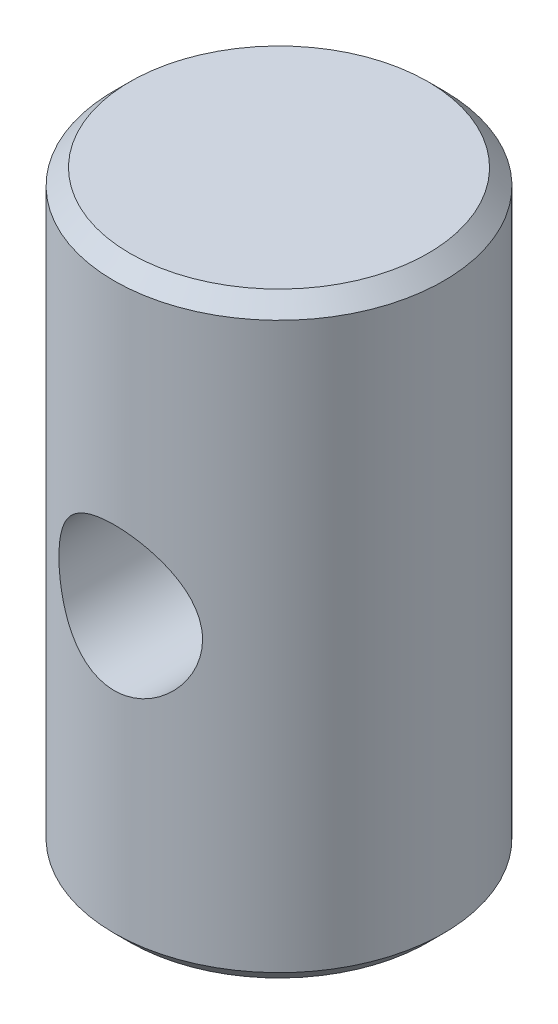
ISO-10303-21;
HEADER;
FILE_DESCRIPTION(('STEP AP214'),'2;1');
FILE_NAME('part.step','',(''),(''),'','','');
FILE_SCHEMA(('AUTOMOTIVE_DESIGN { 1 0 10303 214 1 1 1 1 }'));
ENDSEC;
DATA;
#1=APPLICATION_CONTEXT('core data for automotive mechanical design processes');
#2=APPLICATION_PROTOCOL_DEFINITION('international standard','automotive_design',2000,#1);
#3=PRODUCT_CONTEXT('',#1,'mechanical');
#4=PRODUCT('Part','Part','',(#3));
#5=PRODUCT_RELATED_PRODUCT_CATEGORY('part','',(#4));
#6=PRODUCT_DEFINITION_FORMATION('','',#4);
#7=PRODUCT_DEFINITION_CONTEXT('part definition',#1,'design');
#8=PRODUCT_DEFINITION('design','',#6,#7);
#9=PRODUCT_DEFINITION_SHAPE('','',#8);
#10=(LENGTH_UNIT() NAMED_UNIT(*) SI_UNIT(.MILLI.,.METRE.));
#11=(NAMED_UNIT(*) PLANE_ANGLE_UNIT() SI_UNIT($,.RADIAN.));
#12=(NAMED_UNIT(*) SI_UNIT($,.STERADIAN.) SOLID_ANGLE_UNIT());
#13=UNCERTAINTY_MEASURE_WITH_UNIT(LENGTH_MEASURE(1.E-05),#10,'distance_accuracy_value','');
#14=(GEOMETRIC_REPRESENTATION_CONTEXT(3) GLOBAL_UNCERTAINTY_ASSIGNED_CONTEXT((#13)) GLOBAL_UNIT_ASSIGNED_CONTEXT((#10,
#11,#12)) REPRESENTATION_CONTEXT('',''));
#15=CARTESIAN_POINT('',(0.,0.,0.));
#16=DIRECTION('',(0.,0.,1.));
#17=DIRECTION('',(1.,0.,0.));
#18=AXIS2_PLACEMENT_3D('',#15,#16,#17);
#19=CARTESIAN_POINT('',(0.,14.351,0.));
#20=DIRECTION('',(0.,-1.,0.));
#21=DIRECTION('',(0.,0.,-1.));
#22=AXIS2_PLACEMENT_3D('',#19,#20,#21);
#23=CYLINDRICAL_SURFACE('',#22,3.9624);
#24=CARTESIAN_POINT('',(1.72719999999999,7.1628,3.56614552703616));
#25=CARTESIAN_POINT('',(1.72719589741108,7.07113387059166,3.56614993077733));
#26=CARTESIAN_POINT('',(1.7198563547776,6.9793146178966,3.56973092522893));
#27=CARTESIAN_POINT('',(1.69081256466767,6.79836471975493,3.58357547788538));
#28=CARTESIAN_POINT('',(1.66907105976061,6.70924167628412,3.59385636739064));
#29=CARTESIAN_POINT('',(1.61224827694548,6.53662551523054,3.61970021391957));
#30=CARTESIAN_POINT('',(1.57722487269376,6.45310979708089,3.63524022403528));
#31=CARTESIAN_POINT('',(1.49500578565154,6.29316182054083,3.66981650660831));
#32=CARTESIAN_POINT('',(1.44781218552927,6.21672835321407,3.68885218069734));
#33=CARTESIAN_POINT('',(1.33915027419395,6.06785473138358,3.72972629681702));
#34=CARTESIAN_POINT('',(1.27697890078482,5.99595508122913,3.75166530796737));
#35=CARTESIAN_POINT('',(1.1415997053979,5.8631987124269,3.79505136644032));
#36=CARTESIAN_POINT('',(1.06838740960763,5.80234649235768,3.81649821025787));
#37=CARTESIAN_POINT('',(0.908670114004438,5.69056161394339,3.85772570091534));
#38=CARTESIAN_POINT('',(0.821694106038829,5.64024944000791,3.8773759773678));
#39=CARTESIAN_POINT('',(0.639499839563158,5.55520813096961,3.91154996359957));
#40=CARTESIAN_POINT('',(0.544285594873899,5.52047145763201,3.92607615260836));
#41=CARTESIAN_POINT('',(0.354004474453537,5.46956458647761,3.94764982511964));
#42=CARTESIAN_POINT('',(0.259231279574775,5.45245895379762,3.95507241461706));
#43=CARTESIAN_POINT('',(0.0678890738924134,5.43426453734702,3.96297326142524));
#44=CARTESIAN_POINT('',(-0.0286791157575744,5.43316860182497,3.96345461947811));
#45=CARTESIAN_POINT('',(-0.21401993129242,5.44656196520325,3.95763057708474));
#46=CARTESIAN_POINT('',(-0.302883957933034,5.46001982846568,3.95177430819683));
#47=CARTESIAN_POINT('',(-0.476944676567913,5.50035407791297,3.9345633932956));
#48=CARTESIAN_POINT('',(-0.562141096735372,5.52723145683962,3.92320834049804));
#49=CARTESIAN_POINT('',(-0.728026639089413,5.5939421456383,3.89586603541674));
#50=CARTESIAN_POINT('',(-0.808626905603861,5.63396730489782,3.87981059847104));
#51=CARTESIAN_POINT('',(-0.9621790800613,5.72563783228495,3.84461178823216));
#52=CARTESIAN_POINT('',(-1.03512820484004,5.77728740754321,3.82546729765473));
#53=CARTESIAN_POINT('',(-1.17721181969114,5.89529983549193,3.78426569350375));
#54=CARTESIAN_POINT('',(-1.24563357525797,5.96248324454074,3.76209779908373));
#55=CARTESIAN_POINT('',(-1.37056544109138,6.10737251655165,3.71840738174161));
#56=CARTESIAN_POINT('',(-1.4270700545781,6.18508320819918,3.69688516054486));
#57=CARTESIAN_POINT('',(-1.52864446774681,6.35260056060402,3.65608781778757));
#58=CARTESIAN_POINT('',(-1.57318542786002,6.44275959623804,3.63693230997906));
#59=CARTESIAN_POINT('',(-1.64615514374342,6.63035261029733,3.60449719801011));
#60=CARTESIAN_POINT('',(-1.67459667664862,6.72778074997144,3.59121293604016));
#61=CARTESIAN_POINT('',(-1.71265446245399,6.91998586667292,3.57321211924259));
#62=CARTESIAN_POINT('',(-1.72343422801931,7.01448193413677,3.5679676487184));
#63=CARTESIAN_POINT('',(-1.72930635611274,7.20405814926641,3.56512687568415));
#64=CARTESIAN_POINT('',(-1.72440506063362,7.29913804528603,3.56752748122481));
#65=CARTESIAN_POINT('',(-1.70011832298708,7.4798545126876,3.5791569267607));
#66=CARTESIAN_POINT('',(-1.68181579551821,7.56567392560942,3.58787477116406));
#67=CARTESIAN_POINT('',(-1.63271771102618,7.73293532205738,3.61048078266554));
#68=CARTESIAN_POINT('',(-1.60191904401184,7.81437621015468,3.62437023678313));
#69=CARTESIAN_POINT('',(-1.52720876846257,7.97459431983546,3.65649623494314));
#70=CARTESIAN_POINT('',(-1.48277877423512,8.05309568427869,3.67489747406086));
#71=CARTESIAN_POINT('',(-1.38256674795293,8.20192765054499,3.71375937788475));
#72=CARTESIAN_POINT('',(-1.32677949731932,8.27225447280262,3.73422098712417));
#73=CARTESIAN_POINT('',(-1.19948482874214,8.40938735909963,3.77713548868492));
#74=CARTESIAN_POINT('',(-1.12701063383752,8.47529586406847,3.79960069661503));
#75=CARTESIAN_POINT('',(-0.971535731074497,8.59420328023158,3.84229423811627));
#76=CARTESIAN_POINT('',(-0.888533778841646,8.64720066317279,3.86252230672895));
#77=CARTESIAN_POINT('',(-0.713363972849648,8.73892270332071,3.89868757505321));
#78=CARTESIAN_POINT('',(-0.621139909518708,8.77755209321188,3.91459595172678));
#79=CARTESIAN_POINT('',(-0.430623283302368,8.83843900311843,3.9401000488249));
#80=CARTESIAN_POINT('',(-0.332334757521396,8.86070728991486,3.94969992025898));
#81=CARTESIAN_POINT('',(-0.140461012272613,8.88679276605566,3.96098741868394));
#82=CARTESIAN_POINT('',(-0.0470781868625247,8.89187193505369,3.96321592377827));
#83=CARTESIAN_POINT('',(0.139194491913483,8.88689964312438,3.96104868747177));
#84=CARTESIAN_POINT('',(0.232084442924303,8.87685130073712,3.95665431137927));
#85=CARTESIAN_POINT('',(0.41073834890137,8.8428129906973,3.94203210863175));
#86=CARTESIAN_POINT('',(0.496638051959683,8.81941893219932,3.9320539492743));
#87=CARTESIAN_POINT('',(0.663238778514837,8.76003495200585,3.90740654114818));
#88=CARTESIAN_POINT('',(0.743938862312723,8.72404276103657,3.89273644727279));
#89=CARTESIAN_POINT('',(0.901932977314781,8.6386613837307,3.85926808870117));
#90=CARTESIAN_POINT('',(0.978901999050528,8.58873436390756,3.84031159534644));
#91=CARTESIAN_POINT('',(1.12370588773836,8.47765374175666,3.80046684162582));
#92=CARTESIAN_POINT('',(1.19153699805237,8.41649554650857,3.77957779269371));
#93=CARTESIAN_POINT('',(1.32148064662441,8.27926661955781,3.73622039367739));
#94=CARTESIAN_POINT('',(1.3827753146848,8.20241879921604,3.71375182625651));
#95=CARTESIAN_POINT('',(1.49175885005103,8.03888803959137,3.6713350648878));
#96=CARTESIAN_POINT('',(1.53943955533862,7.95219924366032,3.65138838687139));
#97=CARTESIAN_POINT('',(1.6196050663497,7.77101173405566,3.61654750540729));
#98=CARTESIAN_POINT('',(1.65207959254433,7.67650778789674,3.60165672165858));
#99=CARTESIAN_POINT('',(1.70023951426616,7.4826606357442,3.5791796844223));
#100=CARTESIAN_POINT('',(1.71598123416848,7.38333484894709,3.57156893429829));
#101=CARTESIAN_POINT('',(1.72438769192046,7.26337632757507,3.56750597176856));
#102=CARTESIAN_POINT('',(1.72544131653243,7.24328107414503,3.56699684271771));
#103=CARTESIAN_POINT('',(1.72684792846381,7.2030596765425,3.5663161331941));
#104=CARTESIAN_POINT('',(1.72720090109186,7.18293353173113,3.56614455979927));
#105=CARTESIAN_POINT('',(1.72719999999999,7.1628,3.56614552703616));
#106=B_SPLINE_CURVE_WITH_KNOTS('',3,(#24,#25,#26,#27,#28,#29,#30,#31,#32,#33,#34,#35,#36,#37,
#38,#39,#40,#41,#42,#43,#44,#45,#46,#47,#48,#49,#50,#51,#52,#53,#54,#55,#56,#57,#58,#59,#60,#61,
#62,#63,#64,#65,#66,#67,#68,#69,#70,#71,#72,#73,#74,#75,#76,#77,#78,#79,#80,#81,#82,#83,#84,#85,
#86,#87,#88,#89,#90,#91,#92,#93,#94,#95,#96,#97,#98,#99,#100,#101,#102,#103,#104,#105),
.UNSPECIFIED.,.T.,.F.,(4,2,2,2,2,2,2,2,2,2,2,2,2,2,2,2,2,2,2,2,2,2,2,2,2,2,2,2,2,2,2,2,2,2,2,2,
2,2,2,2,4),(0.,0.27491360060961,0.550541186246354,0.824981319003145,1.09937451834224,
1.39076193437484,1.68226774023018,1.98784235201367,2.29326891166307,2.5814948127249,
2.8695919553817,3.13853317485298,3.40749429286321,3.68056864002003,3.95374197814749,
4.24770338801559,4.54180009242742,4.84730969142455,5.15257648487916,5.43678031040862,
5.72086920808196,5.98422984023225,6.24765605680784,6.52269943356455,6.79786947721351,
7.09799209145049,7.39815021311258,7.70026448721379,8.00217976991364,8.28138332266196,
8.56052932541228,8.82809027882377,9.09569945222209,9.37555849602336,9.65553224235741,
9.95663459830248,10.2579170977655,10.5594029742113,10.8598707724349,10.920251478834,
10.9806334512912),.UNSPECIFIED.);
#107=CARTESIAN_POINT('',(1.72719999999999,7.1628,3.56614552703616));
#108=VERTEX_POINT('',#107);
#109=EDGE_CURVE('E37',#108,#108,#106,.T.);
#110=ORIENTED_EDGE('',*,*,#109,.T.);
#111=EDGE_LOOP('',(#110));
#112=FACE_BOUND('',#111,.T.);
#113=CARTESIAN_POINT('',(0.,0.381000000000001,0.));
#114=DIRECTION('',(0.,1.,0.));
#115=DIRECTION('',(0.,0.,1.));
#116=AXIS2_PLACEMENT_3D('',#113,#114,#115);
#117=CIRCLE('',#116,3.9624);
#118=CARTESIAN_POINT('',(0.,0.381000000000001,3.9624));
#119=VERTEX_POINT('',#118);
#120=EDGE_CURVE('E64',#119,#119,#117,.T.);
#121=ORIENTED_EDGE('',*,*,#120,.T.);
#122=EDGE_LOOP('',(#121));
#123=FACE_BOUND('',#122,.T.);
#124=CARTESIAN_POINT('',(0.,13.97,0.));
#125=DIRECTION('',(0.,1.,0.));
#126=DIRECTION('',(0.,0.,1.));
#127=AXIS2_PLACEMENT_3D('',#124,#125,#126);
#128=CIRCLE('',#127,3.9624);
#129=CARTESIAN_POINT('',(0.,13.97,3.9624));
#130=VERTEX_POINT('',#129);
#131=EDGE_CURVE('E60',#130,#130,#128,.F.);
#132=ORIENTED_EDGE('',*,*,#131,.T.);
#133=EDGE_LOOP('',(#132));
#134=FACE_BOUND('',#133,.T.);
#135=ADVANCED_FACE('F33',(#112,#123,#134),#23,.T.);
#136=CARTESIAN_POINT('',(0.,14.351,0.));
#137=DIRECTION('',(0.,1.,0.));
#138=DIRECTION('',(0.,0.,1.));
#139=AXIS2_PLACEMENT_3D('',#136,#137,#138);
#140=PLANE('',#139);
#141=CARTESIAN_POINT('',(0.,14.351,0.));
#142=DIRECTION('',(0.,1.,0.));
#143=DIRECTION('',(0.,0.,1.));
#144=AXIS2_PLACEMENT_3D('',#141,#142,#143);
#145=CIRCLE('',#144,3.5814);
#146=CARTESIAN_POINT('',(0.,14.351,3.5814));
#147=VERTEX_POINT('',#146);
#148=EDGE_CURVE('E11',#147,#147,#145,.T.);
#149=ORIENTED_EDGE('',*,*,#148,.T.);
#150=EDGE_LOOP('',(#149));
#151=FACE_BOUND('',#150,.T.);
#152=ADVANCED_FACE('F79',(#151),#140,.T.);
#153=CARTESIAN_POINT('',(0.,0.,0.));
#154=DIRECTION('',(0.,1.,0.));
#155=DIRECTION('',(0.,0.,1.));
#156=AXIS2_PLACEMENT_3D('',#153,#154,#155);
#157=PLANE('',#156);
#158=CARTESIAN_POINT('',(0.,0.,0.));
#159=DIRECTION('',(0.,1.,0.));
#160=DIRECTION('',(0.,0.,1.));
#161=AXIS2_PLACEMENT_3D('',#158,#159,#160);
#162=CIRCLE('',#161,3.5814);
#163=CARTESIAN_POINT('',(0.,0.,3.5814));
#164=VERTEX_POINT('',#163);
#165=EDGE_CURVE('E46',#164,#164,#162,.F.);
#166=ORIENTED_EDGE('',*,*,#165,.T.);
#167=EDGE_LOOP('',(#166));
#168=FACE_BOUND('',#167,.T.);
#169=ADVANCED_FACE('F70',(#168),#157,.F.);
#170=CARTESIAN_POINT('',(0.,0.381000000000001,0.));
#171=DIRECTION('',(0.,1.,0.));
#172=DIRECTION('',(0.,0.,1.));
#173=AXIS2_PLACEMENT_3D('',#170,#171,#172);
#174=CONICAL_SURFACE('',#173,3.9624,0.785398163397451);
#175=ORIENTED_EDGE('',*,*,#165,.F.);
#176=EDGE_LOOP('',(#175));
#177=FACE_BOUND('',#176,.T.);
#178=ORIENTED_EDGE('',*,*,#120,.F.);
#179=EDGE_LOOP('',(#178));
#180=FACE_BOUND('',#179,.T.);
#181=ADVANCED_FACE('F72',(#177,#180),#174,.T.);
#182=CARTESIAN_POINT('',(0.,14.351,0.));
#183=DIRECTION('',(0.,-1.,0.));
#184=DIRECTION('',(0.,0.,-1.));
#185=AXIS2_PLACEMENT_3D('',#182,#183,#184);
#186=CONICAL_SURFACE('',#185,3.5814,0.785398163397446);
#187=ORIENTED_EDGE('',*,*,#131,.F.);
#188=EDGE_LOOP('',(#187));
#189=FACE_BOUND('',#188,.T.);
#190=ORIENTED_EDGE('',*,*,#148,.F.);
#191=EDGE_LOOP('',(#190));
#192=FACE_BOUND('',#191,.T.);
#193=ADVANCED_FACE('F35',(#189,#192),#186,.T.);
#194=CARTESIAN_POINT('',(0.,7.1628,3.96875));
#195=DIRECTION('',(0.,0.,1.));
#196=DIRECTION('',(1.,0.,0.));
#197=AXIS2_PLACEMENT_3D('',#194,#195,#196);
#198=CYLINDRICAL_SURFACE('',#197,1.72719999999999);
#199=CARTESIAN_POINT('',(0.,7.1628,-2.38124999999999));
#200=DIRECTION('',(0.,0.,1.));
#201=DIRECTION('',(1.,0.,0.));
#202=AXIS2_PLACEMENT_3D('',#199,#200,#201);
#203=CIRCLE('',#202,1.72719999999999);
#204=CARTESIAN_POINT('',(1.72719999999999,7.1628,-2.38124999999999));
#205=VERTEX_POINT('',#204);
#206=EDGE_CURVE('E56',#205,#205,#203,.T.);
#207=ORIENTED_EDGE('',*,*,#206,.F.);
#208=EDGE_LOOP('',(#207));
#209=FACE_BOUND('',#208,.T.);
#210=ORIENTED_EDGE('',*,*,#109,.F.);
#211=EDGE_LOOP('',(#210));
#212=FACE_BOUND('',#211,.T.);
#213=ADVANCED_FACE('F52',(#209,#212),#198,.F.);
#214=CARTESIAN_POINT('',(0.,7.1628,-2.38124999999999));
#215=DIRECTION('',(0.,0.,1.));
#216=DIRECTION('',(1.,0.,0.));
#217=AXIS2_PLACEMENT_3D('',#214,#215,#216);
#218=CONICAL_SURFACE('',#217,1.72719999999999,1.02974425867665);
#219=CARTESIAN_POINT('',(0.,7.1628,-3.41905646118439));
#220=VERTEX_POINT('',#219);
#221=VERTEX_LOOP('',#220);
#222=FACE_BOUND('',#221,.T.);
#223=ORIENTED_EDGE('',*,*,#206,.T.);
#224=EDGE_LOOP('',(#223));
#225=FACE_BOUND('',#224,.T.);
#226=ADVANCED_FACE('F49',(#222,#225),#218,.F.);
#227=CLOSED_SHELL('',(#135,#152,#169,#181,#193,#213,#226));
#228=MANIFOLD_SOLID_BREP('B2',#227);
#229=ADVANCED_BREP_SHAPE_REPRESENTATION('',(#18,#228),#14);
#230=SHAPE_DEFINITION_REPRESENTATION(#9,#229);
ENDSEC;
END-ISO-10303-21;
